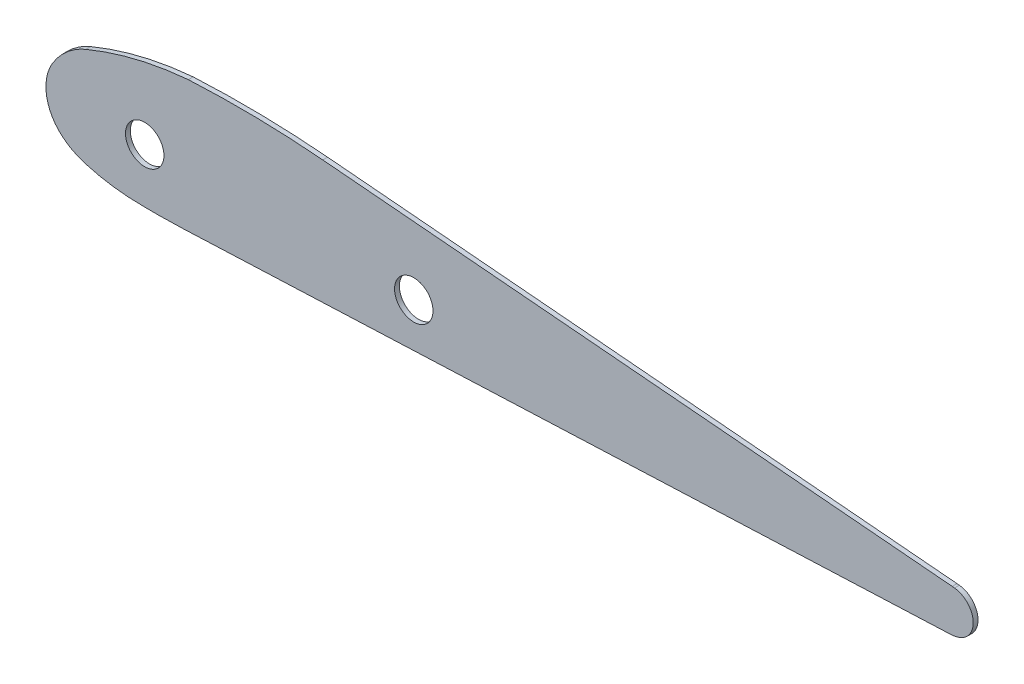
ISO-10303-21;
HEADER;
FILE_DESCRIPTION(('STEP AP214'),'2;1');
FILE_NAME('part.step','',(''),(''),'','','');
FILE_SCHEMA(('AUTOMOTIVE_DESIGN { 1 0 10303 214 1 1 1 1 }'));
ENDSEC;
DATA;
#1=APPLICATION_CONTEXT('core data for automotive mechanical design processes');
#2=APPLICATION_PROTOCOL_DEFINITION('international standard','automotive_design',2000,#1);
#3=PRODUCT_CONTEXT('',#1,'mechanical');
#4=PRODUCT('Part','Part','',(#3));
#5=PRODUCT_RELATED_PRODUCT_CATEGORY('part','',(#4));
#6=PRODUCT_DEFINITION_FORMATION('','',#4);
#7=PRODUCT_DEFINITION_CONTEXT('part definition',#1,'design');
#8=PRODUCT_DEFINITION('design','',#6,#7);
#9=PRODUCT_DEFINITION_SHAPE('','',#8);
#10=(LENGTH_UNIT() NAMED_UNIT(*) SI_UNIT(.MILLI.,.METRE.));
#11=(NAMED_UNIT(*) PLANE_ANGLE_UNIT() SI_UNIT($,.RADIAN.));
#12=(NAMED_UNIT(*) SI_UNIT($,.STERADIAN.) SOLID_ANGLE_UNIT());
#13=UNCERTAINTY_MEASURE_WITH_UNIT(LENGTH_MEASURE(1.E-05),#10,'distance_accuracy_value','');
#14=(GEOMETRIC_REPRESENTATION_CONTEXT(3) GLOBAL_UNCERTAINTY_ASSIGNED_CONTEXT((#13)) GLOBAL_UNIT_ASSIGNED_CONTEXT((#10,
#11,#12)) REPRESENTATION_CONTEXT('',''));
#15=CARTESIAN_POINT('',(0.,0.,0.));
#16=DIRECTION('',(0.,0.,1.));
#17=DIRECTION('',(1.,0.,0.));
#18=AXIS2_PLACEMENT_3D('',#15,#16,#17);
#19=CARTESIAN_POINT('',(1180.25726769186,35.0088131971411,3.175));
#20=CARTESIAN_POINT('',(1193.13966007545,40.3677263180318,3.175));
#21=CARTESIAN_POINT('',(1206.50216892791,44.7576514654492,3.175));
#22=CARTESIAN_POINT('',(1220.20233173128,48.1027852412448,3.175));
#23=CARTESIAN_POINT('',(1234.11091659275,50.3691566419875,3.175));
#24=CARTESIAN_POINT('',(1248.06640573756,51.5491200892669,3.175));
#25=(BOUNDED_CURVE() B_SPLINE_CURVE(5,(#19,#20,#21,#22,#23,#24),.UNSPECIFIED.,.F.,
.F.) B_SPLINE_CURVE_WITH_KNOTS((6,6),(0.,1.),
.UNSPECIFIED.) CURVE() GEOMETRIC_REPRESENTATION_ITEM() RATIONAL_B_SPLINE_CURVE((1.,1.,1.,1.,1.,1.)) REPRESENTATION_ITEM(''));
#26=DIRECTION('',(0.,0.,-1.));
#27=VECTOR('',#26,1.);
#28=SURFACE_OF_LINEAR_EXTRUSION('',#25,#27);
#29=CARTESIAN_POINT('',(1180.25726769186,35.0088131971411,0.));
#30=CARTESIAN_POINT('',(1193.13966007545,40.3677263180318,0.));
#31=CARTESIAN_POINT('',(1206.50216892791,44.7576514654492,0.));
#32=CARTESIAN_POINT('',(1220.20233173128,48.1027852412448,0.));
#33=CARTESIAN_POINT('',(1234.11091659275,50.3691566419875,0.));
#34=CARTESIAN_POINT('',(1248.06640573756,51.5491200892669,0.));
#35=(BOUNDED_CURVE() B_SPLINE_CURVE(5,(#29,#30,#31,#32,#33,#34),.UNSPECIFIED.,.F.,
.F.) B_SPLINE_CURVE_WITH_KNOTS((6,6),(0.,1.),
.UNSPECIFIED.) CURVE() GEOMETRIC_REPRESENTATION_ITEM() RATIONAL_B_SPLINE_CURVE((1.,1.,1.,1.,1.,1.)) REPRESENTATION_ITEM(''));
#36=CARTESIAN_POINT('',(1180.25726769186,35.0088131971411,0.));
#37=VERTEX_POINT('',#36);
#38=CARTESIAN_POINT('',(1248.06640573756,51.5491200892669,0.));
#39=VERTEX_POINT('',#38);
#40=EDGE_CURVE('E290',#37,#39,#35,.T.);
#41=ORIENTED_EDGE('',*,*,#40,.F.);
#42=DIRECTION('',(0.,0.,-1.));
#43=VECTOR('',#42,1.);
#44=CARTESIAN_POINT('',(1180.25726769186,35.0088131971411,3.175));
#45=LINE('',#44,#43);
#46=CARTESIAN_POINT('',(1180.25726769186,35.0088131971411,3.175));
#47=VERTEX_POINT('',#46);
#48=EDGE_CURVE('E11',#47,#37,#45,.T.);
#49=ORIENTED_EDGE('',*,*,#48,.F.);
#50=CARTESIAN_POINT('',(1248.06640573756,51.5491200892669,3.175));
#51=VERTEX_POINT('',#50);
#52=EDGE_CURVE('E267',#47,#51,#25,.T.);
#53=ORIENTED_EDGE('',*,*,#52,.T.);
#54=DIRECTION('',(0.,0.,-1.));
#55=VECTOR('',#54,1.);
#56=CARTESIAN_POINT('',(1248.06640573756,51.5491200892669,3.175));
#57=LINE('',#56,#55);
#58=EDGE_CURVE('E57',#51,#39,#57,.T.);
#59=ORIENTED_EDGE('',*,*,#58,.T.);
#60=EDGE_LOOP('',(#41,#49,#53,#59));
#61=FACE_BOUND('',#60,.T.);
#62=ADVANCED_FACE('F39',(#61),#28,.T.);
#63=CARTESIAN_POINT('',(1157.90866368724,15.4236985633263,3.175));
#64=CARTESIAN_POINT('',(1160.88778295765,20.5818040106375,3.175));
#65=CARTESIAN_POINT('',(1164.76160636457,25.3361666864829,3.175));
#66=CARTESIAN_POINT('',(1169.42863580498,29.4363144369361,3.175));
#67=CARTESIAN_POINT('',(1174.6789489905,32.6883030866549,3.175));
#68=CARTESIAN_POINT('',(1180.25726769186,35.0088131971411,3.175));
#69=(BOUNDED_CURVE() B_SPLINE_CURVE(5,(#63,#64,#65,#66,#67,#68),.UNSPECIFIED.,.F.,
.F.) B_SPLINE_CURVE_WITH_KNOTS((6,6),(0.,1.),
.UNSPECIFIED.) CURVE() GEOMETRIC_REPRESENTATION_ITEM() RATIONAL_B_SPLINE_CURVE((1.,1.,1.,1.,1.,1.)) REPRESENTATION_ITEM(''));
#70=DIRECTION('',(0.,0.,-1.));
#71=VECTOR('',#70,1.);
#72=SURFACE_OF_LINEAR_EXTRUSION('',#69,#71);
#73=CARTESIAN_POINT('',(1157.90866368724,15.4236985633263,0.));
#74=CARTESIAN_POINT('',(1160.88778295765,20.5818040106375,0.));
#75=CARTESIAN_POINT('',(1164.76160636457,25.3361666864829,0.));
#76=CARTESIAN_POINT('',(1169.42863580498,29.4363144369361,0.));
#77=CARTESIAN_POINT('',(1174.6789489905,32.6883030866549,0.));
#78=CARTESIAN_POINT('',(1180.25726769186,35.0088131971411,0.));
#79=(BOUNDED_CURVE() B_SPLINE_CURVE(5,(#73,#74,#75,#76,#77,#78),.UNSPECIFIED.,.F.,
.F.) B_SPLINE_CURVE_WITH_KNOTS((6,6),(0.,1.),
.UNSPECIFIED.) CURVE() GEOMETRIC_REPRESENTATION_ITEM() RATIONAL_B_SPLINE_CURVE((1.,1.,1.,1.,1.,1.)) REPRESENTATION_ITEM(''));
#80=CARTESIAN_POINT('',(1157.90866368724,15.4236985633263,0.));
#81=VERTEX_POINT('',#80);
#82=EDGE_CURVE('E284',#81,#37,#79,.T.);
#83=ORIENTED_EDGE('',*,*,#82,.F.);
#84=DIRECTION('',(0.,0.,-1.));
#85=VECTOR('',#84,1.);
#86=CARTESIAN_POINT('',(1157.90866368724,15.4236985633263,3.175));
#87=LINE('',#86,#85);
#88=CARTESIAN_POINT('',(1157.90866368724,15.4236985633263,3.175));
#89=VERTEX_POINT('',#88);
#90=EDGE_CURVE('E49',#89,#81,#87,.T.);
#91=ORIENTED_EDGE('',*,*,#90,.F.);
#92=EDGE_CURVE('E258',#89,#47,#69,.T.);
#93=ORIENTED_EDGE('',*,*,#92,.T.);
#94=ORIENTED_EDGE('',*,*,#48,.T.);
#95=EDGE_LOOP('',(#83,#91,#93,#94));
#96=FACE_BOUND('',#95,.T.);
#97=ADVANCED_FACE('F274',(#96),#72,.T.);
#98=CARTESIAN_POINT('',(1165.15710333586,-22.9055828188745,3.175));
#99=CARTESIAN_POINT('',(1158.48797035997,-17.5351641095859,3.175));
#100=CARTESIAN_POINT('',(1153.72282467065,-9.79720226105936,3.175));
#101=CARTESIAN_POINT('',(1152.04816563218,-0.661270672679153,3.175));
#102=CARTESIAN_POINT('',(1153.71518673156,8.16303096711847,3.175));
#103=CARTESIAN_POINT('',(1157.90866368724,15.4236985633263,3.175));
#104=(BOUNDED_CURVE() B_SPLINE_CURVE(5,(#98,#99,#100,#101,#102,#103),.UNSPECIFIED.,.F.,
.F.) B_SPLINE_CURVE_WITH_KNOTS((6,6),(0.,1.),
.UNSPECIFIED.) CURVE() GEOMETRIC_REPRESENTATION_ITEM() RATIONAL_B_SPLINE_CURVE((1.,1.,1.,1.,1.,1.)) REPRESENTATION_ITEM(''));
#105=DIRECTION('',(0.,0.,-1.));
#106=VECTOR('',#105,1.);
#107=SURFACE_OF_LINEAR_EXTRUSION('',#104,#106);
#108=CARTESIAN_POINT('',(1165.15710333586,-22.9055828188745,0.));
#109=CARTESIAN_POINT('',(1158.48797035997,-17.5351641095859,0.));
#110=CARTESIAN_POINT('',(1153.72282467065,-9.79720226105936,0.));
#111=CARTESIAN_POINT('',(1152.04816563218,-0.661270672679153,0.));
#112=CARTESIAN_POINT('',(1153.71518673156,8.16303096711847,0.));
#113=CARTESIAN_POINT('',(1157.90866368724,15.4236985633263,0.));
#114=(BOUNDED_CURVE() B_SPLINE_CURVE(5,(#108,#109,#110,#111,#112,#113),.UNSPECIFIED.,.F.,
.F.) B_SPLINE_CURVE_WITH_KNOTS((6,6),(0.,1.),
.UNSPECIFIED.) CURVE() GEOMETRIC_REPRESENTATION_ITEM() RATIONAL_B_SPLINE_CURVE((1.,1.,1.,1.,1.,1.)) REPRESENTATION_ITEM(''));
#115=CARTESIAN_POINT('',(1165.15710333586,-22.9055828188745,0.));
#116=VERTEX_POINT('',#115);
#117=EDGE_CURVE('E289',#116,#81,#114,.T.);
#118=ORIENTED_EDGE('',*,*,#117,.F.);
#119=DIRECTION('',(0.,0.,-1.));
#120=VECTOR('',#119,1.);
#121=CARTESIAN_POINT('',(1165.15710333586,-22.9055828188745,3.175));
#122=LINE('',#121,#120);
#123=CARTESIAN_POINT('',(1165.15710333586,-22.9055828188745,3.175));
#124=VERTEX_POINT('',#123);
#125=EDGE_CURVE('E400',#124,#116,#122,.T.);
#126=ORIENTED_EDGE('',*,*,#125,.F.);
#127=EDGE_CURVE('E248',#124,#89,#104,.T.);
#128=ORIENTED_EDGE('',*,*,#127,.T.);
#129=ORIENTED_EDGE('',*,*,#90,.T.);
#130=EDGE_LOOP('',(#118,#126,#128,#129));
#131=FACE_BOUND('',#130,.T.);
#132=ADVANCED_FACE('F239',(#131),#107,.T.);
#133=CARTESIAN_POINT('',(1179.3995623926,-30.3821765231966,3.175));
#134=CARTESIAN_POINT('',(1176.30861719431,-29.4651239673329,3.175));
#135=CARTESIAN_POINT('',(1173.29713600848,-28.243926124,3.175));
#136=CARTESIAN_POINT('',(1170.40894713813,-26.7291939219884,3.175));
#137=CARTESIAN_POINT('',(1167.68381971373,-24.9402586545059,3.175));
#138=CARTESIAN_POINT('',(1165.15710333586,-22.9055828188745,3.175));
#139=(BOUNDED_CURVE() B_SPLINE_CURVE(5,(#133,#134,#135,#136,#137,#138),.UNSPECIFIED.,.F.,
.F.) B_SPLINE_CURVE_WITH_KNOTS((6,6),(0.,1.),
.UNSPECIFIED.) CURVE() GEOMETRIC_REPRESENTATION_ITEM() RATIONAL_B_SPLINE_CURVE((1.,1.,1.,1.,1.,1.)) REPRESENTATION_ITEM(''));
#140=DIRECTION('',(0.,0.,-1.));
#141=VECTOR('',#140,1.);
#142=SURFACE_OF_LINEAR_EXTRUSION('',#139,#141);
#143=CARTESIAN_POINT('',(1179.3995623926,-30.3821765231966,0.));
#144=CARTESIAN_POINT('',(1176.30861719431,-29.4651239673329,0.));
#145=CARTESIAN_POINT('',(1173.29713600848,-28.243926124,0.));
#146=CARTESIAN_POINT('',(1170.40894713813,-26.7291939219884,0.));
#147=CARTESIAN_POINT('',(1167.68381971373,-24.9402586545059,0.));
#148=CARTESIAN_POINT('',(1165.15710333586,-22.9055828188745,0.));
#149=(BOUNDED_CURVE() B_SPLINE_CURVE(5,(#143,#144,#145,#146,#147,#148),.UNSPECIFIED.,.F.,
.F.) B_SPLINE_CURVE_WITH_KNOTS((6,6),(0.,1.),
.UNSPECIFIED.) CURVE() GEOMETRIC_REPRESENTATION_ITEM() RATIONAL_B_SPLINE_CURVE((1.,1.,1.,1.,1.,1.)) REPRESENTATION_ITEM(''));
#150=CARTESIAN_POINT('',(1179.3995623926,-30.3821765231966,0.));
#151=VERTEX_POINT('',#150);
#152=EDGE_CURVE('E298',#151,#116,#149,.T.);
#153=ORIENTED_EDGE('',*,*,#152,.F.);
#154=DIRECTION('',(0.,0.,-1.));
#155=VECTOR('',#154,1.);
#156=CARTESIAN_POINT('',(1179.3995623926,-30.3821765231966,3.175));
#157=LINE('',#156,#155);
#158=CARTESIAN_POINT('',(1179.3995623926,-30.3821765231966,3.175));
#159=VERTEX_POINT('',#158);
#160=EDGE_CURVE('E397',#159,#151,#157,.T.);
#161=ORIENTED_EDGE('',*,*,#160,.F.);
#162=EDGE_CURVE('E242',#159,#124,#139,.T.);
#163=ORIENTED_EDGE('',*,*,#162,.T.);
#164=ORIENTED_EDGE('',*,*,#125,.T.);
#165=EDGE_LOOP('',(#153,#161,#163,#164));
#166=FACE_BOUND('',#165,.T.);
#167=ADVANCED_FACE('F235',(#166),#142,.T.);
#168=CARTESIAN_POINT('',(1208.3507392511,-35.4598511795865,3.175));
#169=CARTESIAN_POINT('',(1202.46647731624,-35.1126720954404,3.175));
#170=CARTESIAN_POINT('',(1196.59137728506,-34.4270595349146,3.175));
#171=CARTESIAN_POINT('',(1190.76508497594,-33.403835369934,3.175));
#172=CARTESIAN_POINT('',(1185.02237347125,-32.0504083677398,3.175));
#173=CARTESIAN_POINT('',(1179.3995623926,-30.3821765231966,3.175));
#174=(BOUNDED_CURVE() B_SPLINE_CURVE(5,(#168,#169,#170,#171,#172,#173),.UNSPECIFIED.,.F.,
.F.) B_SPLINE_CURVE_WITH_KNOTS((6,6),(0.,1.),
.UNSPECIFIED.) CURVE() GEOMETRIC_REPRESENTATION_ITEM() RATIONAL_B_SPLINE_CURVE((1.,1.,1.,1.,1.,1.)) REPRESENTATION_ITEM(''));
#175=DIRECTION('',(0.,0.,-1.));
#176=VECTOR('',#175,1.);
#177=SURFACE_OF_LINEAR_EXTRUSION('',#174,#176);
#178=CARTESIAN_POINT('',(1208.3507392511,-35.4598511795865,0.));
#179=CARTESIAN_POINT('',(1202.46647731624,-35.1126720954404,0.));
#180=CARTESIAN_POINT('',(1196.59137728506,-34.4270595349146,0.));
#181=CARTESIAN_POINT('',(1190.76508497594,-33.403835369934,0.));
#182=CARTESIAN_POINT('',(1185.02237347125,-32.0504083677398,0.));
#183=CARTESIAN_POINT('',(1179.3995623926,-30.3821765231966,0.));
#184=(BOUNDED_CURVE() B_SPLINE_CURVE(5,(#178,#179,#180,#181,#182,#183),.UNSPECIFIED.,.F.,
.F.) B_SPLINE_CURVE_WITH_KNOTS((6,6),(0.,1.),
.UNSPECIFIED.) CURVE() GEOMETRIC_REPRESENTATION_ITEM() RATIONAL_B_SPLINE_CURVE((1.,1.,1.,1.,1.,1.)) REPRESENTATION_ITEM(''));
#185=CARTESIAN_POINT('',(1208.3507392511,-35.4598511795865,0.));
#186=VERTEX_POINT('',#185);
#187=EDGE_CURVE('E302',#186,#151,#184,.T.);
#188=ORIENTED_EDGE('',*,*,#187,.F.);
#189=DIRECTION('',(0.,0.,-1.));
#190=VECTOR('',#189,1.);
#191=CARTESIAN_POINT('',(1208.3507392511,-35.4598511795865,3.175));
#192=LINE('',#191,#190);
#193=CARTESIAN_POINT('',(1208.3507392511,-35.4598511795865,3.175));
#194=VERTEX_POINT('',#193);
#195=EDGE_CURVE('E394',#194,#186,#192,.T.);
#196=ORIENTED_EDGE('',*,*,#195,.F.);
#197=EDGE_CURVE('E218',#194,#159,#174,.T.);
#198=ORIENTED_EDGE('',*,*,#197,.T.);
#199=ORIENTED_EDGE('',*,*,#160,.T.);
#200=EDGE_LOOP('',(#188,#196,#198,#199));
#201=FACE_BOUND('',#200,.T.);
#202=ADVANCED_FACE('F231',(#201),#177,.T.);
#203=CARTESIAN_POINT('',(1244.43473718082,-35.4801574601294,3.175));
#204=CARTESIAN_POINT('',(1237.20914689011,-35.7854291222274,3.175));
#205=CARTESIAN_POINT('',(1229.97704628598,-35.9353075778932,3.175));
#206=CARTESIAN_POINT('',(1222.76561566871,-35.9312342254262,3.175));
#207=CARTESIAN_POINT('',(1215.55133172922,-35.7725853609792,3.175));
#208=CARTESIAN_POINT('',(1208.3507392511,-35.4598511795865,3.175));
#209=(BOUNDED_CURVE() B_SPLINE_CURVE(5,(#203,#204,#205,#206,#207,#208),.UNSPECIFIED.,.F.,
.F.) B_SPLINE_CURVE_WITH_KNOTS((6,6),(2.44739050189764E-07,1.),
.UNSPECIFIED.) CURVE() GEOMETRIC_REPRESENTATION_ITEM() RATIONAL_B_SPLINE_CURVE((1.,1.,1.,1.,1.,1.)) REPRESENTATION_ITEM(''));
#210=DIRECTION('',(0.,0.,-1.));
#211=VECTOR('',#210,1.);
#212=SURFACE_OF_LINEAR_EXTRUSION('',#209,#211);
#213=CARTESIAN_POINT('',(1244.43473718082,-35.4801574601294,0.));
#214=CARTESIAN_POINT('',(1237.20914689011,-35.7854291222274,0.));
#215=CARTESIAN_POINT('',(1229.97704628598,-35.9353075778932,0.));
#216=CARTESIAN_POINT('',(1222.76561566871,-35.9312342254262,0.));
#217=CARTESIAN_POINT('',(1215.55133172922,-35.7725853609792,0.));
#218=CARTESIAN_POINT('',(1208.3507392511,-35.4598511795865,0.));
#219=(BOUNDED_CURVE() B_SPLINE_CURVE(5,(#213,#214,#215,#216,#217,#218),.UNSPECIFIED.,.F.,
.F.) B_SPLINE_CURVE_WITH_KNOTS((6,6),(2.44739050189764E-07,1.),
.UNSPECIFIED.) CURVE() GEOMETRIC_REPRESENTATION_ITEM() RATIONAL_B_SPLINE_CURVE((1.,1.,1.,1.,1.,1.)) REPRESENTATION_ITEM(''));
#220=CARTESIAN_POINT('',(1244.43473673872,-35.4801574788074,0.));
#221=VERTEX_POINT('',#220);
#222=EDGE_CURVE('E322',#221,#186,#219,.T.);
#223=ORIENTED_EDGE('',*,*,#222,.F.);
#224=DIRECTION('',(0.,0.,-1.));
#225=VECTOR('',#224,1.);
#226=CARTESIAN_POINT('',(1244.43473673872,-35.4801574788074,3.175));
#227=LINE('',#226,#225);
#228=CARTESIAN_POINT('',(1244.43473673872,-35.4801574788074,3.175));
#229=VERTEX_POINT('',#228);
#230=EDGE_CURVE('E391',#229,#221,#227,.T.);
#231=ORIENTED_EDGE('',*,*,#230,.F.);
#232=EDGE_CURVE('E211',#229,#194,#209,.T.);
#233=ORIENTED_EDGE('',*,*,#232,.T.);
#234=ORIENTED_EDGE('',*,*,#195,.T.);
#235=EDGE_LOOP('',(#223,#231,#233,#234));
#236=FACE_BOUND('',#235,.T.);
#237=ADVANCED_FACE('F227',(#236),#212,.T.);
#238=CARTESIAN_POINT('',(3.71361622505585,-87.8989874936685,3.175));
#239=DIRECTION('',(0.0422110248330945,-0.999108717499022,0.));
#240=DIRECTION('',(0.999108717499022,0.0422110248330945,0.));
#241=AXIS2_PLACEMENT_3D('',#238,#239,#240);
#242=PLANE('',#241);
#243=DIRECTION('',(-0.999108717499022,-0.0422110248330945,0.));
#244=VECTOR('',#243,1.);
#245=CARTESIAN_POINT('',(3.71361622505585,-87.8989874936685,0.));
#246=LINE('',#245,#244);
#247=CARTESIAN_POINT('',(1751.41228036273,-14.0610252973737,0.));
#248=VERTEX_POINT('',#247);
#249=EDGE_CURVE('E331',#248,#221,#246,.T.);
#250=ORIENTED_EDGE('',*,*,#249,.F.);
#251=DIRECTION('',(0.,0.,-1.));
#252=VECTOR('',#251,1.);
#253=CARTESIAN_POINT('',(1751.41228036273,-14.0610252973737,3.175));
#254=LINE('',#253,#252);
#255=CARTESIAN_POINT('',(1751.41228036273,-14.0610252973737,3.175));
#256=VERTEX_POINT('',#255);
#257=EDGE_CURVE('E388',#256,#248,#254,.T.);
#258=ORIENTED_EDGE('',*,*,#257,.F.);
#259=DIRECTION('',(-0.999108717499022,-0.0422110248330945,0.));
#260=VECTOR('',#259,1.);
#261=CARTESIAN_POINT('',(3.71361622505585,-87.8989874936685,3.175));
#262=LINE('',#261,#260);
#263=EDGE_CURVE('E204',#256,#229,#262,.T.);
#264=ORIENTED_EDGE('',*,*,#263,.T.);
#265=ORIENTED_EDGE('',*,*,#230,.T.);
#266=EDGE_LOOP('',(#250,#258,#264,#265));
#267=FACE_BOUND('',#266,.T.);
#268=ADVANCED_FACE('F230',(#267),#242,.T.);
#269=CARTESIAN_POINT('',(1757.00847821638,-13.1026483570977,3.175));
#270=CARTESIAN_POINT('',(1755.92113070105,-13.4375826258489,3.175));
#271=CARTESIAN_POINT('',(1754.80174982904,-13.7051346356604,3.175));
#272=CARTESIAN_POINT('',(1753.69333740383,-13.8936120855084,3.175));
#273=CARTESIAN_POINT('',(1752.55424356123,-14.0125421352259,3.175));
#274=CARTESIAN_POINT('',(1751.41228036273,-14.0610252973737,3.175));
#275=(BOUNDED_CURVE() B_SPLINE_CURVE(5,(#269,#270,#271,#272,#273,#274),.UNSPECIFIED.,.F.,
.F.) B_SPLINE_CURVE_WITH_KNOTS((6,6),(0.,1.),
.UNSPECIFIED.) CURVE() GEOMETRIC_REPRESENTATION_ITEM() RATIONAL_B_SPLINE_CURVE((1.,1.,1.,1.,1.,1.)) REPRESENTATION_ITEM(''));
#276=DIRECTION('',(0.,0.,-1.));
#277=VECTOR('',#276,1.);
#278=SURFACE_OF_LINEAR_EXTRUSION('',#275,#277);
#279=CARTESIAN_POINT('',(1757.00847821638,-13.1026483570977,0.));
#280=CARTESIAN_POINT('',(1755.92113070105,-13.4375826258489,0.));
#281=CARTESIAN_POINT('',(1754.80174982904,-13.7051346356604,0.));
#282=CARTESIAN_POINT('',(1753.69333740383,-13.8936120855084,0.));
#283=CARTESIAN_POINT('',(1752.55424356123,-14.0125421352259,0.));
#284=CARTESIAN_POINT('',(1751.41228036273,-14.0610252973737,0.));
#285=(BOUNDED_CURVE() B_SPLINE_CURVE(5,(#279,#280,#281,#282,#283,#284),.UNSPECIFIED.,.F.,
.F.) B_SPLINE_CURVE_WITH_KNOTS((6,6),(0.,1.),
.UNSPECIFIED.) CURVE() GEOMETRIC_REPRESENTATION_ITEM() RATIONAL_B_SPLINE_CURVE((1.,1.,1.,1.,1.,1.)) REPRESENTATION_ITEM(''));
#286=CARTESIAN_POINT('',(1757.00847821638,-13.1026483570977,0.));
#287=VERTEX_POINT('',#286);
#288=EDGE_CURVE('E338',#287,#248,#285,.T.);
#289=ORIENTED_EDGE('',*,*,#288,.F.);
#290=DIRECTION('',(0.,0.,-1.));
#291=VECTOR('',#290,1.);
#292=CARTESIAN_POINT('',(1757.00847821638,-13.1026483570977,3.175));
#293=LINE('',#292,#291);
#294=CARTESIAN_POINT('',(1757.00847821638,-13.1026483570977,3.175));
#295=VERTEX_POINT('',#294);
#296=EDGE_CURVE('E385',#295,#287,#293,.T.);
#297=ORIENTED_EDGE('',*,*,#296,.F.);
#298=EDGE_CURVE('E194',#295,#256,#275,.T.);
#299=ORIENTED_EDGE('',*,*,#298,.T.);
#300=ORIENTED_EDGE('',*,*,#257,.T.);
#301=EDGE_LOOP('',(#289,#297,#299,#300));
#302=FACE_BOUND('',#301,.T.);
#303=ADVANCED_FACE('F186',(#302),#278,.T.);
#304=CARTESIAN_POINT('',(1754.34507253522,13.8030551308361,3.175));
#305=CARTESIAN_POINT('',(1758.16398696313,13.3775209726007,3.175));
#306=CARTESIAN_POINT('',(1761.80833133438,11.6377790335942,3.175));
#307=CARTESIAN_POINT('',(1764.65699140459,8.6975933339511,3.175));
#308=CARTESIAN_POINT('',(1767.9123402951,1.40175493474054,3.175));
#309=CARTESIAN_POINT('',(1766.03687674368,-6.33005982718017,3.175));
#310=CARTESIAN_POINT('',(1763.76155461805,-9.69968778717242,3.175));
#311=CARTESIAN_POINT('',(1760.56686631257,-12.0065624549872,3.175));
#312=CARTESIAN_POINT('',(1757.00847821638,-13.1026483570977,3.175));
#313=(BOUNDED_CURVE() B_SPLINE_CURVE(5,(#304,#305,#306,#307,#308,#309,#310,#311,#312),
.UNSPECIFIED.,.F.,.F.) B_SPLINE_CURVE_WITH_KNOTS((6,3,6),(0.,0.499136526106799,1.),
.UNSPECIFIED.) CURVE() GEOMETRIC_REPRESENTATION_ITEM() RATIONAL_B_SPLINE_CURVE((1.,1.,1.,1.,1.,
1.,1.,1.,1.)) REPRESENTATION_ITEM(''));
#314=DIRECTION('',(0.,0.,-1.));
#315=VECTOR('',#314,1.);
#316=SURFACE_OF_LINEAR_EXTRUSION('',#313,#315);
#317=CARTESIAN_POINT('',(1754.34507253522,13.8030551308361,0.));
#318=CARTESIAN_POINT('',(1758.16398696313,13.3775209726007,0.));
#319=CARTESIAN_POINT('',(1761.80833133438,11.6377790335942,0.));
#320=CARTESIAN_POINT('',(1764.65699140459,8.6975933339511,0.));
#321=CARTESIAN_POINT('',(1767.9123402951,1.40175493474054,0.));
#322=CARTESIAN_POINT('',(1766.03687674368,-6.33005982718017,0.));
#323=CARTESIAN_POINT('',(1763.76155461805,-9.69968778717242,0.));
#324=CARTESIAN_POINT('',(1760.56686631257,-12.0065624549872,0.));
#325=CARTESIAN_POINT('',(1757.00847821638,-13.1026483570977,0.));
#326=(BOUNDED_CURVE() B_SPLINE_CURVE(5,(#317,#318,#319,#320,#321,#322,#323,#324,#325),
.UNSPECIFIED.,.F.,.F.) B_SPLINE_CURVE_WITH_KNOTS((6,3,6),(0.,0.499136526106799,1.),
.UNSPECIFIED.) CURVE() GEOMETRIC_REPRESENTATION_ITEM() RATIONAL_B_SPLINE_CURVE((1.,1.,1.,1.,1.,
1.,1.,1.,1.)) REPRESENTATION_ITEM(''));
#327=CARTESIAN_POINT('',(1754.34507253522,13.8030551308361,0.));
#328=VERTEX_POINT('',#327);
#329=EDGE_CURVE('E344',#328,#287,#326,.T.);
#330=ORIENTED_EDGE('',*,*,#329,.F.);
#331=DIRECTION('',(0.,0.,-1.));
#332=VECTOR('',#331,1.);
#333=CARTESIAN_POINT('',(1754.34507253522,13.8030551308361,3.175));
#334=LINE('',#333,#332);
#335=CARTESIAN_POINT('',(1754.34507253522,13.8030551308361,3.175));
#336=VERTEX_POINT('',#335);
#337=EDGE_CURVE('E153',#336,#328,#334,.T.);
#338=ORIENTED_EDGE('',*,*,#337,.F.);
#339=EDGE_CURVE('E141',#336,#295,#313,.T.);
#340=ORIENTED_EDGE('',*,*,#339,.T.);
#341=ORIENTED_EDGE('',*,*,#296,.T.);
#342=EDGE_LOOP('',(#330,#338,#340,#341));
#343=FACE_BOUND('',#342,.T.);
#344=ADVANCED_FACE('F183',(#343),#316,.T.);
#345=CARTESIAN_POINT('',(14.5976529387797,166.412844139329,3.175));
#346=DIRECTION('',(-0.0873839558197947,-0.99617470569438,0.));
#347=DIRECTION('',(0.99617470569438,-0.0873839558197947,0.));
#348=AXIS2_PLACEMENT_3D('',#345,#346,#347);
#349=PLANE('',#348);
#350=DIRECTION('',(-0.99617470569438,0.0873839558197947,0.));
#351=VECTOR('',#350,1.);
#352=CARTESIAN_POINT('',(14.5976529387797,166.412844139329,0.));
#353=LINE('',#352,#351);
#354=CARTESIAN_POINT('',(1752.80898003812,13.9378004100873,0.));
#355=VERTEX_POINT('',#354);
#356=EDGE_CURVE('E149',#328,#355,#353,.T.);
#357=ORIENTED_EDGE('',*,*,#356,.T.);
#358=DIRECTION('',(0.,0.,-1.));
#359=VECTOR('',#358,1.);
#360=CARTESIAN_POINT('',(1752.80898003812,13.9378004100873,3.175));
#361=LINE('',#360,#359);
#362=CARTESIAN_POINT('',(1752.80898003812,13.9378004100873,3.175));
#363=VERTEX_POINT('',#362);
#364=EDGE_CURVE('E146',#363,#355,#361,.T.);
#365=ORIENTED_EDGE('',*,*,#364,.F.);
#366=DIRECTION('',(-0.99617470569438,0.0873839558197947,0.));
#367=VECTOR('',#366,1.);
#368=CARTESIAN_POINT('',(14.5976529387797,166.412844139329,3.175));
#369=LINE('',#368,#367);
#370=EDGE_CURVE('E132',#336,#363,#369,.T.);
#371=ORIENTED_EDGE('',*,*,#370,.F.);
#372=ORIENTED_EDGE('',*,*,#337,.T.);
#373=EDGE_LOOP('',(#357,#365,#371,#372));
#374=FACE_BOUND('',#373,.T.);
#375=ADVANCED_FACE('F147',(#374),#349,.F.);
#376=CARTESIAN_POINT('',(14.2970476113273,164.779398717767,3.175));
#377=DIRECTION('',(0.0864400203097189,0.996257056631899,0.));
#378=DIRECTION('',(-0.996257056631899,0.0864400203097189,0.));
#379=AXIS2_PLACEMENT_3D('',#376,#377,#378);
#380=PLANE('',#379);
#381=DIRECTION('',(0.996257056631899,-0.0864400203097189,0.));
#382=VECTOR('',#381,1.);
#383=CARTESIAN_POINT('',(14.2970476113273,164.779398717767,0.));
#384=LINE('',#383,#382);
#385=CARTESIAN_POINT('',(1336.88934152201,50.0249746601635,0.));
#386=VERTEX_POINT('',#385);
#387=EDGE_CURVE('E358',#386,#355,#384,.T.);
#388=ORIENTED_EDGE('',*,*,#387,.F.);
#389=DIRECTION('',(0.,0.,-1.));
#390=VECTOR('',#389,1.);
#391=CARTESIAN_POINT('',(1336.88934152201,50.0249746601635,3.175));
#392=LINE('',#391,#390);
#393=CARTESIAN_POINT('',(1336.88934152201,50.0249746601635,3.175));
#394=VERTEX_POINT('',#393);
#395=EDGE_CURVE('E94',#394,#386,#392,.T.);
#396=ORIENTED_EDGE('',*,*,#395,.F.);
#397=DIRECTION('',(0.996257056631899,-0.0864400203097189,0.));
#398=VECTOR('',#397,1.);
#399=CARTESIAN_POINT('',(14.2970476113273,164.779398717767,3.175));
#400=LINE('',#399,#398);
#401=EDGE_CURVE('E138',#394,#363,#400,.T.);
#402=ORIENTED_EDGE('',*,*,#401,.T.);
#403=ORIENTED_EDGE('',*,*,#364,.T.);
#404=EDGE_LOOP('',(#388,#396,#402,#403));
#405=FACE_BOUND('',#404,.T.);
#406=ADVANCED_FACE('F155',(#405),#380,.T.);
#407=CARTESIAN_POINT('',(1397.,0.,3.175));
#408=DIRECTION('',(0.,0.,-1.));
#409=DIRECTION('',(-1.,0.,0.));
#410=AXIS2_PLACEMENT_3D('',#407,#408,#409);
#411=CYLINDRICAL_SURFACE('',#410,12.6999999999999);
#412=CARTESIAN_POINT('',(1397.,0.,3.175));
#413=DIRECTION('',(0.,0.,1.));
#414=DIRECTION('',(1.,0.,0.));
#415=AXIS2_PLACEMENT_3D('',#412,#413,#414);
#416=CIRCLE('',#415,12.6999999999999);
#417=CARTESIAN_POINT('',(1409.7,0.,3.175));
#418=VERTEX_POINT('',#417);
#419=EDGE_CURVE('E160',#418,#418,#416,.T.);
#420=ORIENTED_EDGE('',*,*,#419,.T.);
#421=EDGE_LOOP('',(#420));
#422=FACE_BOUND('',#421,.T.);
#423=CARTESIAN_POINT('',(1397.,0.,0.));
#424=DIRECTION('',(0.,0.,1.));
#425=DIRECTION('',(1.,0.,0.));
#426=AXIS2_PLACEMENT_3D('',#423,#424,#425);
#427=CIRCLE('',#426,12.6999999999999);
#428=CARTESIAN_POINT('',(1409.7,0.,0.));
#429=VERTEX_POINT('',#428);
#430=EDGE_CURVE('E367',#429,#429,#427,.T.);
#431=ORIENTED_EDGE('',*,*,#430,.F.);
#432=EDGE_LOOP('',(#431));
#433=FACE_BOUND('',#432,.T.);
#434=ADVANCED_FACE('F177',(#422,#433),#411,.F.);
#435=CARTESIAN_POINT('',(1248.06640573756,51.5491200892669,3.175));
#436=CARTESIAN_POINT('',(1265.67982888558,52.4748239171554,3.175));
#437=CARTESIAN_POINT('',(1283.36800419767,52.7890806367716,3.175));
#438=CARTESIAN_POINT('',(1301.37048481839,52.4801252852254,3.175));
#439=CARTESIAN_POINT('',(1319.15681763971,51.5635331179392,3.175));
#440=CARTESIAN_POINT('',(1336.88934152201,50.0249746601635,3.175));
#441=(BOUNDED_CURVE() B_SPLINE_CURVE(5,(#435,#436,#437,#438,#439,#440),.UNSPECIFIED.,.F.,
.F.) B_SPLINE_CURVE_WITH_KNOTS((6,6),(0.,1.),
.UNSPECIFIED.) CURVE() GEOMETRIC_REPRESENTATION_ITEM() RATIONAL_B_SPLINE_CURVE((1.,1.,1.,1.,1.,1.)) REPRESENTATION_ITEM(''));
#442=DIRECTION('',(0.,0.,-1.));
#443=VECTOR('',#442,1.);
#444=SURFACE_OF_LINEAR_EXTRUSION('',#441,#443);
#445=CARTESIAN_POINT('',(1248.06640573756,51.5491200892669,0.));
#446=CARTESIAN_POINT('',(1265.67982888558,52.4748239171554,0.));
#447=CARTESIAN_POINT('',(1283.36800419767,52.7890806367716,0.));
#448=CARTESIAN_POINT('',(1301.37048481839,52.4801252852254,0.));
#449=CARTESIAN_POINT('',(1319.15681763971,51.5635331179392,0.));
#450=CARTESIAN_POINT('',(1336.88934152201,50.0249746601635,0.));
#451=(BOUNDED_CURVE() B_SPLINE_CURVE(5,(#445,#446,#447,#448,#449,#450),.UNSPECIFIED.,.F.,
.F.) B_SPLINE_CURVE_WITH_KNOTS((6,6),(0.,1.),
.UNSPECIFIED.) CURVE() GEOMETRIC_REPRESENTATION_ITEM() RATIONAL_B_SPLINE_CURVE((1.,1.,1.,1.,1.,1.)) REPRESENTATION_ITEM(''));
#452=EDGE_CURVE('E361',#39,#386,#451,.T.);
#453=ORIENTED_EDGE('',*,*,#452,.F.);
#454=ORIENTED_EDGE('',*,*,#58,.F.);
#455=EDGE_CURVE('E157',#51,#394,#441,.T.);
#456=ORIENTED_EDGE('',*,*,#455,.T.);
#457=ORIENTED_EDGE('',*,*,#395,.T.);
#458=EDGE_LOOP('',(#453,#454,#456,#457));
#459=FACE_BOUND('',#458,.T.);
#460=ADVANCED_FACE('F172',(#459),#444,.T.);
#461=CARTESIAN_POINT('',(1219.2,0.,3.175));
#462=DIRECTION('',(0.,0.,-1.));
#463=DIRECTION('',(-1.,0.,0.));
#464=AXIS2_PLACEMENT_3D('',#461,#462,#463);
#465=CYLINDRICAL_SURFACE('',#464,12.7000000000001);
#466=CARTESIAN_POINT('',(1219.2,0.,3.175));
#467=DIRECTION('',(0.,0.,1.));
#468=DIRECTION('',(1.,0.,0.));
#469=AXIS2_PLACEMENT_3D('',#466,#467,#468);
#470=CIRCLE('',#469,12.7000000000001);
#471=CARTESIAN_POINT('',(1231.9,0.,3.175));
#472=VERTEX_POINT('',#471);
#473=EDGE_CURVE('E380',#472,#472,#470,.T.);
#474=ORIENTED_EDGE('',*,*,#473,.T.);
#475=EDGE_LOOP('',(#474));
#476=FACE_BOUND('',#475,.T.);
#477=CARTESIAN_POINT('',(1219.2,0.,0.));
#478=DIRECTION('',(0.,0.,1.));
#479=DIRECTION('',(1.,0.,0.));
#480=AXIS2_PLACEMENT_3D('',#477,#478,#479);
#481=CIRCLE('',#480,12.7000000000001);
#482=CARTESIAN_POINT('',(1231.9,0.,0.));
#483=VERTEX_POINT('',#482);
#484=EDGE_CURVE('E374',#483,#483,#481,.T.);
#485=ORIENTED_EDGE('',*,*,#484,.F.);
#486=EDGE_LOOP('',(#485));
#487=FACE_BOUND('',#486,.T.);
#488=ADVANCED_FACE('F176',(#476,#487),#465,.F.);
#489=CARTESIAN_POINT('',(0.,0.,3.175));
#490=DIRECTION('',(0.,0.,1.));
#491=DIRECTION('',(1.,0.,0.));
#492=AXIS2_PLACEMENT_3D('',#489,#490,#491);
#493=PLANE('',#492);
#494=ORIENTED_EDGE('',*,*,#52,.F.);
#495=ORIENTED_EDGE('',*,*,#92,.F.);
#496=ORIENTED_EDGE('',*,*,#127,.F.);
#497=ORIENTED_EDGE('',*,*,#162,.F.);
#498=ORIENTED_EDGE('',*,*,#197,.F.);
#499=ORIENTED_EDGE('',*,*,#232,.F.);
#500=ORIENTED_EDGE('',*,*,#263,.F.);
#501=ORIENTED_EDGE('',*,*,#298,.F.);
#502=ORIENTED_EDGE('',*,*,#339,.F.);
#503=ORIENTED_EDGE('',*,*,#370,.T.);
#504=ORIENTED_EDGE('',*,*,#401,.F.);
#505=ORIENTED_EDGE('',*,*,#455,.F.);
#506=EDGE_LOOP('',(#494,#495,#496,#497,#498,#499,#500,#501,#502,#503,#504,#505));
#507=FACE_BOUND('',#506,.T.);
#508=ORIENTED_EDGE('',*,*,#419,.F.);
#509=EDGE_LOOP('',(#508));
#510=FACE_BOUND('',#509,.T.);
#511=ORIENTED_EDGE('',*,*,#473,.F.);
#512=EDGE_LOOP('',(#511));
#513=FACE_BOUND('',#512,.T.);
#514=ADVANCED_FACE('F134',(#507,#510,#513),#493,.T.);
#515=CARTESIAN_POINT('',(0.,0.,0.));
#516=DIRECTION('',(0.,0.,1.));
#517=DIRECTION('',(1.,0.,0.));
#518=AXIS2_PLACEMENT_3D('',#515,#516,#517);
#519=PLANE('',#518);
#520=ORIENTED_EDGE('',*,*,#40,.T.);
#521=ORIENTED_EDGE('',*,*,#452,.T.);
#522=ORIENTED_EDGE('',*,*,#387,.T.);
#523=ORIENTED_EDGE('',*,*,#356,.F.);
#524=ORIENTED_EDGE('',*,*,#329,.T.);
#525=ORIENTED_EDGE('',*,*,#288,.T.);
#526=ORIENTED_EDGE('',*,*,#249,.T.);
#527=ORIENTED_EDGE('',*,*,#222,.T.);
#528=ORIENTED_EDGE('',*,*,#187,.T.);
#529=ORIENTED_EDGE('',*,*,#152,.T.);
#530=ORIENTED_EDGE('',*,*,#117,.T.);
#531=ORIENTED_EDGE('',*,*,#82,.T.);
#532=EDGE_LOOP('',(#520,#521,#522,#523,#524,#525,#526,#527,#528,#529,#530,#531));
#533=FACE_BOUND('',#532,.T.);
#534=ORIENTED_EDGE('',*,*,#430,.T.);
#535=EDGE_LOOP('',(#534));
#536=FACE_BOUND('',#535,.T.);
#537=ORIENTED_EDGE('',*,*,#484,.T.);
#538=EDGE_LOOP('',(#537));
#539=FACE_BOUND('',#538,.T.);
#540=ADVANCED_FACE('F294',(#533,#536,#539),#519,.F.);
#541=CLOSED_SHELL('',(#62,#97,#132,#167,#202,#237,#268,#303,#344,#375,#406,#434,#460,#488,#514,#540));
#542=MANIFOLD_SOLID_BREP('B2',#541);
#543=ADVANCED_BREP_SHAPE_REPRESENTATION('',(#18,#542),#14);
#544=SHAPE_DEFINITION_REPRESENTATION(#9,#543);
ENDSEC;
END-ISO-10303-21;
